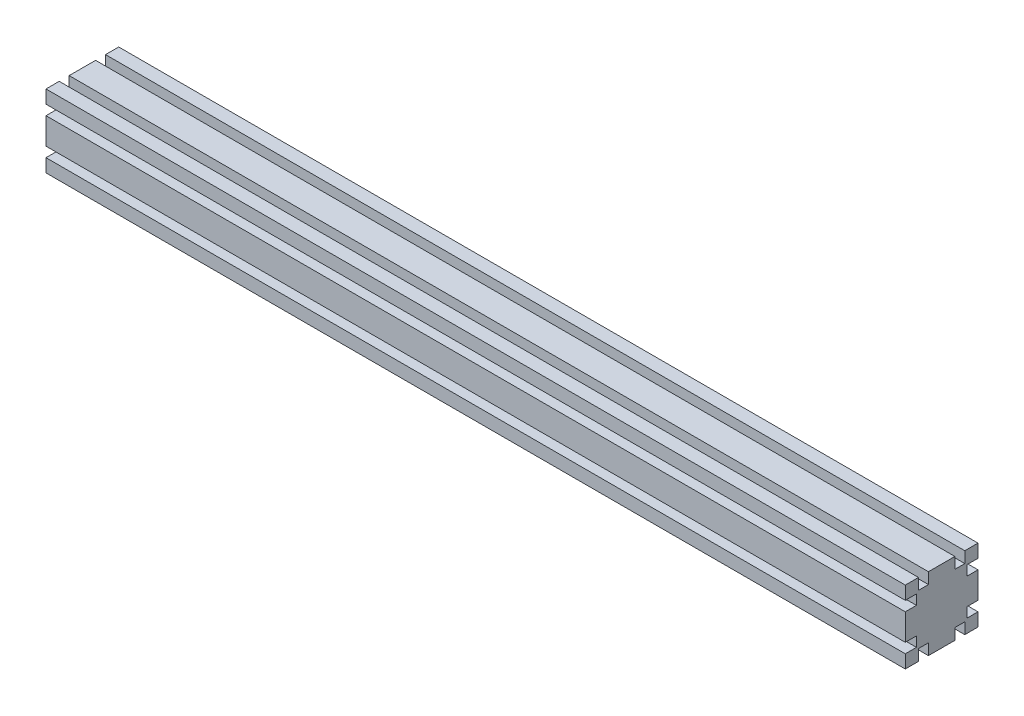
ISO-10303-21;
HEADER;
FILE_DESCRIPTION(('STEP AP214'),'2;1');
FILE_NAME('part.step','',(''),(''),'','','');
FILE_SCHEMA(('AUTOMOTIVE_DESIGN { 1 0 10303 214 1 1 1 1 }'));
ENDSEC;
DATA;
#1=APPLICATION_CONTEXT('core data for automotive mechanical design processes');
#2=APPLICATION_PROTOCOL_DEFINITION('international standard','automotive_design',2000,#1);
#3=PRODUCT_CONTEXT('',#1,'mechanical');
#4=PRODUCT('Part','Part','',(#3));
#5=PRODUCT_RELATED_PRODUCT_CATEGORY('part','',(#4));
#6=PRODUCT_DEFINITION_FORMATION('','',#4);
#7=PRODUCT_DEFINITION_CONTEXT('part definition',#1,'design');
#8=PRODUCT_DEFINITION('design','',#6,#7);
#9=PRODUCT_DEFINITION_SHAPE('','',#8);
#10=(LENGTH_UNIT() NAMED_UNIT(*) SI_UNIT(.MILLI.,.METRE.));
#11=(NAMED_UNIT(*) PLANE_ANGLE_UNIT() SI_UNIT($,.RADIAN.));
#12=(NAMED_UNIT(*) SI_UNIT($,.STERADIAN.) SOLID_ANGLE_UNIT());
#13=UNCERTAINTY_MEASURE_WITH_UNIT(LENGTH_MEASURE(1.E-05),#10,'distance_accuracy_value','');
#14=(GEOMETRIC_REPRESENTATION_CONTEXT(3) GLOBAL_UNCERTAINTY_ASSIGNED_CONTEXT((#13)) GLOBAL_UNIT_ASSIGNED_CONTEXT((#10,
#11,#12)) REPRESENTATION_CONTEXT('',''));
#15=CARTESIAN_POINT('',(0.,0.,0.));
#16=DIRECTION('',(0.,0.,1.));
#17=DIRECTION('',(1.,0.,0.));
#18=AXIS2_PLACEMENT_3D('',#15,#16,#17);
#19=CARTESIAN_POINT('',(709.,30.,-30.));
#20=DIRECTION('',(0.,0.,1.));
#21=DIRECTION('',(0.,-1.,0.));
#22=AXIS2_PLACEMENT_3D('',#19,#20,#21);
#23=PLANE('',#22);
#24=DIRECTION('',(0.,1.,0.));
#25=VECTOR('',#24,1.);
#26=CARTESIAN_POINT('',(709.,30.,-30.));
#27=LINE('',#26,#25);
#28=CARTESIAN_POINT('',(709.,19.1,-30.));
#29=VERTEX_POINT('',#28);
#30=CARTESIAN_POINT('',(709.,30.,-30.));
#31=VERTEX_POINT('',#30);
#32=EDGE_CURVE('E298',#29,#31,#27,.T.);
#33=ORIENTED_EDGE('',*,*,#32,.F.);
#34=DIRECTION('',(-1.,0.,0.));
#35=VECTOR('',#34,1.);
#36=CARTESIAN_POINT('',(709.,19.1,-30.));
#37=LINE('',#36,#35);
#38=CARTESIAN_POINT('',(0.,19.1,-30.));
#39=VERTEX_POINT('',#38);
#40=EDGE_CURVE('E450',#29,#39,#37,.T.);
#41=ORIENTED_EDGE('',*,*,#40,.T.);
#42=DIRECTION('',(0.,1.,0.));
#43=VECTOR('',#42,1.);
#44=CARTESIAN_POINT('',(0.,30.,-30.));
#45=LINE('',#44,#43);
#46=CARTESIAN_POINT('',(0.,30.,-30.));
#47=VERTEX_POINT('',#46);
#48=EDGE_CURVE('E327',#39,#47,#45,.T.);
#49=ORIENTED_EDGE('',*,*,#48,.T.);
#50=DIRECTION('',(-1.,0.,0.));
#51=VECTOR('',#50,1.);
#52=CARTESIAN_POINT('',(709.,30.,-30.));
#53=LINE('',#52,#51);
#54=EDGE_CURVE('E11',#31,#47,#53,.T.);
#55=ORIENTED_EDGE('',*,*,#54,.F.);
#56=EDGE_LOOP('',(#33,#41,#49,#55));
#57=FACE_BOUND('',#56,.T.);
#58=ADVANCED_FACE('F35',(#57),#23,.F.);
#59=CARTESIAN_POINT('',(0.,-10.9,-30.));
#60=VERTEX_POINT('',#59);
#61=CARTESIAN_POINT('',(0.,10.9,-30.));
#62=VERTEX_POINT('',#61);
#63=EDGE_CURVE('E326',#60,#62,#45,.T.);
#64=ORIENTED_EDGE('',*,*,#63,.T.);
#65=DIRECTION('',(-1.,0.,0.));
#66=VECTOR('',#65,1.);
#67=CARTESIAN_POINT('',(709.,10.9,-30.));
#68=LINE('',#67,#66);
#69=CARTESIAN_POINT('',(709.,10.9,-30.));
#70=VERTEX_POINT('',#69);
#71=EDGE_CURVE('E296',#70,#62,#68,.T.);
#72=ORIENTED_EDGE('',*,*,#71,.F.);
#73=CARTESIAN_POINT('',(709.,-10.9,-30.));
#74=VERTEX_POINT('',#73);
#75=EDGE_CURVE('E288',#74,#70,#27,.T.);
#76=ORIENTED_EDGE('',*,*,#75,.F.);
#77=DIRECTION('',(-1.,0.,0.));
#78=VECTOR('',#77,1.);
#79=CARTESIAN_POINT('',(709.,-10.9,-30.));
#80=LINE('',#79,#78);
#81=EDGE_CURVE('E269',#74,#60,#80,.T.);
#82=ORIENTED_EDGE('',*,*,#81,.T.);
#83=EDGE_LOOP('',(#64,#72,#76,#82));
#84=FACE_BOUND('',#83,.T.);
#85=ADVANCED_FACE('F295',(#84),#23,.F.);
#86=CARTESIAN_POINT('',(709.,30.,30.));
#87=DIRECTION('',(0.,-1.,0.));
#88=DIRECTION('',(0.,0.,-1.));
#89=AXIS2_PLACEMENT_3D('',#86,#87,#88);
#90=PLANE('',#89);
#91=DIRECTION('',(0.,0.,1.));
#92=VECTOR('',#91,1.);
#93=CARTESIAN_POINT('',(709.,30.,30.));
#94=LINE('',#93,#92);
#95=CARTESIAN_POINT('',(709.,30.,19.1));
#96=VERTEX_POINT('',#95);
#97=CARTESIAN_POINT('',(709.,30.,30.));
#98=VERTEX_POINT('',#97);
#99=EDGE_CURVE('E301',#96,#98,#94,.T.);
#100=ORIENTED_EDGE('',*,*,#99,.F.);
#101=DIRECTION('',(-1.,0.,0.));
#102=VECTOR('',#101,1.);
#103=CARTESIAN_POINT('',(709.,30.,19.1));
#104=LINE('',#103,#102);
#105=CARTESIAN_POINT('',(0.,30.,19.1));
#106=VERTEX_POINT('',#105);
#107=EDGE_CURVE('E446',#96,#106,#104,.T.);
#108=ORIENTED_EDGE('',*,*,#107,.T.);
#109=DIRECTION('',(0.,0.,1.));
#110=VECTOR('',#109,1.);
#111=CARTESIAN_POINT('',(0.,30.,30.));
#112=LINE('',#111,#110);
#113=CARTESIAN_POINT('',(0.,30.,30.));
#114=VERTEX_POINT('',#113);
#115=EDGE_CURVE('E325',#106,#114,#112,.T.);
#116=ORIENTED_EDGE('',*,*,#115,.T.);
#117=DIRECTION('',(-1.,0.,0.));
#118=VECTOR('',#117,1.);
#119=CARTESIAN_POINT('',(709.,30.,30.));
#120=LINE('',#119,#118);
#121=EDGE_CURVE('E43',#98,#114,#120,.T.);
#122=ORIENTED_EDGE('',*,*,#121,.F.);
#123=EDGE_LOOP('',(#100,#108,#116,#122));
#124=FACE_BOUND('',#123,.T.);
#125=ADVANCED_FACE('F549',(#124),#90,.F.);
#126=CARTESIAN_POINT('',(0.,30.,-10.9));
#127=VERTEX_POINT('',#126);
#128=CARTESIAN_POINT('',(0.,30.,10.9));
#129=VERTEX_POINT('',#128);
#130=EDGE_CURVE('E332',#127,#129,#112,.T.);
#131=ORIENTED_EDGE('',*,*,#130,.T.);
#132=DIRECTION('',(-1.,0.,0.));
#133=VECTOR('',#132,1.);
#134=CARTESIAN_POINT('',(709.,30.,10.9));
#135=LINE('',#134,#133);
#136=CARTESIAN_POINT('',(709.,30.,10.9));
#137=VERTEX_POINT('',#136);
#138=EDGE_CURVE('E58',#137,#129,#135,.T.);
#139=ORIENTED_EDGE('',*,*,#138,.F.);
#140=CARTESIAN_POINT('',(709.,30.,-10.9));
#141=VERTEX_POINT('',#140);
#142=EDGE_CURVE('E311',#141,#137,#94,.T.);
#143=ORIENTED_EDGE('',*,*,#142,.F.);
#144=DIRECTION('',(-1.,0.,0.));
#145=VECTOR('',#144,1.);
#146=CARTESIAN_POINT('',(709.,30.,-10.9));
#147=LINE('',#146,#145);
#148=EDGE_CURVE('E500',#141,#127,#147,.T.);
#149=ORIENTED_EDGE('',*,*,#148,.T.);
#150=EDGE_LOOP('',(#131,#139,#143,#149));
#151=FACE_BOUND('',#150,.T.);
#152=ADVANCED_FACE('F557',(#151),#90,.F.);
#153=CARTESIAN_POINT('',(709.,30.,30.));
#154=DIRECTION('',(0.,0.,-1.));
#155=DIRECTION('',(0.,1.,0.));
#156=AXIS2_PLACEMENT_3D('',#153,#154,#155);
#157=PLANE('',#156);
#158=DIRECTION('',(0.,-1.,0.));
#159=VECTOR('',#158,1.);
#160=CARTESIAN_POINT('',(709.,30.,30.));
#161=LINE('',#160,#159);
#162=CARTESIAN_POINT('',(709.,-19.1,30.));
#163=VERTEX_POINT('',#162);
#164=CARTESIAN_POINT('',(709.,-30.,30.));
#165=VERTEX_POINT('',#164);
#166=EDGE_CURVE('E310',#163,#165,#161,.T.);
#167=ORIENTED_EDGE('',*,*,#166,.F.);
#168=DIRECTION('',(-1.,0.,0.));
#169=VECTOR('',#168,1.);
#170=CARTESIAN_POINT('',(709.,-19.1,30.));
#171=LINE('',#170,#169);
#172=CARTESIAN_POINT('',(0.,-19.1,30.));
#173=VERTEX_POINT('',#172);
#174=EDGE_CURVE('E573',#163,#173,#171,.T.);
#175=ORIENTED_EDGE('',*,*,#174,.T.);
#176=DIRECTION('',(0.,-1.,0.));
#177=VECTOR('',#176,1.);
#178=CARTESIAN_POINT('',(0.,30.,30.));
#179=LINE('',#178,#177);
#180=CARTESIAN_POINT('',(0.,-30.,30.));
#181=VERTEX_POINT('',#180);
#182=EDGE_CURVE('E331',#173,#181,#179,.T.);
#183=ORIENTED_EDGE('',*,*,#182,.T.);
#184=DIRECTION('',(-1.,0.,0.));
#185=VECTOR('',#184,1.);
#186=CARTESIAN_POINT('',(709.,-30.,30.));
#187=LINE('',#186,#185);
#188=EDGE_CURVE('E343',#165,#181,#187,.T.);
#189=ORIENTED_EDGE('',*,*,#188,.F.);
#190=EDGE_LOOP('',(#167,#175,#183,#189));
#191=FACE_BOUND('',#190,.T.);
#192=ADVANCED_FACE('F629',(#191),#157,.F.);
#193=CARTESIAN_POINT('',(0.,10.9,30.));
#194=VERTEX_POINT('',#193);
#195=CARTESIAN_POINT('',(0.,-10.9,30.));
#196=VERTEX_POINT('',#195);
#197=EDGE_CURVE('E337',#194,#196,#179,.T.);
#198=ORIENTED_EDGE('',*,*,#197,.T.);
#199=DIRECTION('',(-1.,0.,0.));
#200=VECTOR('',#199,1.);
#201=CARTESIAN_POINT('',(709.,-10.9,30.));
#202=LINE('',#201,#200);
#203=CARTESIAN_POINT('',(709.,-10.9,30.));
#204=VERTEX_POINT('',#203);
#205=EDGE_CURVE('E591',#204,#196,#202,.T.);
#206=ORIENTED_EDGE('',*,*,#205,.F.);
#207=CARTESIAN_POINT('',(709.,10.9,30.));
#208=VERTEX_POINT('',#207);
#209=EDGE_CURVE('E316',#208,#204,#161,.T.);
#210=ORIENTED_EDGE('',*,*,#209,.F.);
#211=DIRECTION('',(-1.,0.,0.));
#212=VECTOR('',#211,1.);
#213=CARTESIAN_POINT('',(709.,10.9,30.));
#214=LINE('',#213,#212);
#215=EDGE_CURVE('E381',#208,#194,#214,.T.);
#216=ORIENTED_EDGE('',*,*,#215,.T.);
#217=EDGE_LOOP('',(#198,#206,#210,#216));
#218=FACE_BOUND('',#217,.T.);
#219=ADVANCED_FACE('F621',(#218),#157,.F.);
#220=CARTESIAN_POINT('',(709.,-30.,30.));
#221=DIRECTION('',(0.,1.,0.));
#222=DIRECTION('',(0.,0.,1.));
#223=AXIS2_PLACEMENT_3D('',#220,#221,#222);
#224=PLANE('',#223);
#225=DIRECTION('',(0.,0.,-1.));
#226=VECTOR('',#225,1.);
#227=CARTESIAN_POINT('',(709.,-30.,30.));
#228=LINE('',#227,#226);
#229=CARTESIAN_POINT('',(709.,-30.,-19.1));
#230=VERTEX_POINT('',#229);
#231=CARTESIAN_POINT('',(709.,-30.,-30.));
#232=VERTEX_POINT('',#231);
#233=EDGE_CURVE('E315',#230,#232,#228,.T.);
#234=ORIENTED_EDGE('',*,*,#233,.F.);
#235=DIRECTION('',(-1.,0.,0.));
#236=VECTOR('',#235,1.);
#237=CARTESIAN_POINT('',(709.,-30.,-19.1));
#238=LINE('',#237,#236);
#239=CARTESIAN_POINT('',(0.,-30.,-19.1));
#240=VERTEX_POINT('',#239);
#241=EDGE_CURVE('E394',#230,#240,#238,.T.);
#242=ORIENTED_EDGE('',*,*,#241,.T.);
#243=DIRECTION('',(0.,0.,-1.));
#244=VECTOR('',#243,1.);
#245=CARTESIAN_POINT('',(0.,-30.,30.));
#246=LINE('',#245,#244);
#247=CARTESIAN_POINT('',(0.,-30.,-30.));
#248=VERTEX_POINT('',#247);
#249=EDGE_CURVE('E336',#240,#248,#246,.T.);
#250=ORIENTED_EDGE('',*,*,#249,.T.);
#251=DIRECTION('',(-1.,0.,0.));
#252=VECTOR('',#251,1.);
#253=CARTESIAN_POINT('',(709.,-30.,-30.));
#254=LINE('',#253,#252);
#255=EDGE_CURVE('E320',#232,#248,#254,.T.);
#256=ORIENTED_EDGE('',*,*,#255,.F.);
#257=EDGE_LOOP('',(#234,#242,#250,#256));
#258=FACE_BOUND('',#257,.T.);
#259=ADVANCED_FACE('F558',(#258),#224,.F.);
#260=CARTESIAN_POINT('',(0.,-30.,19.1));
#261=VERTEX_POINT('',#260);
#262=EDGE_CURVE('E302',#181,#261,#246,.T.);
#263=ORIENTED_EDGE('',*,*,#262,.T.);
#264=DIRECTION('',(-1.,0.,0.));
#265=VECTOR('',#264,1.);
#266=CARTESIAN_POINT('',(709.,-30.,19.1));
#267=LINE('',#266,#265);
#268=CARTESIAN_POINT('',(709.,-30.,19.1));
#269=VERTEX_POINT('',#268);
#270=EDGE_CURVE('E398',#269,#261,#267,.T.);
#271=ORIENTED_EDGE('',*,*,#270,.F.);
#272=EDGE_CURVE('E317',#165,#269,#228,.T.);
#273=ORIENTED_EDGE('',*,*,#272,.F.);
#274=ORIENTED_EDGE('',*,*,#188,.T.);
#275=EDGE_LOOP('',(#263,#271,#273,#274));
#276=FACE_BOUND('',#275,.T.);
#277=ADVANCED_FACE('F551',(#276),#224,.F.);
#278=CARTESIAN_POINT('',(0.,-19.1,-30.));
#279=VERTEX_POINT('',#278);
#280=EDGE_CURVE('E322',#248,#279,#45,.T.);
#281=ORIENTED_EDGE('',*,*,#280,.T.);
#282=DIRECTION('',(-1.,0.,0.));
#283=VECTOR('',#282,1.);
#284=CARTESIAN_POINT('',(709.,-19.1,-30.));
#285=LINE('',#284,#283);
#286=CARTESIAN_POINT('',(709.,-19.1,-30.));
#287=VERTEX_POINT('',#286);
#288=EDGE_CURVE('E280',#287,#279,#285,.T.);
#289=ORIENTED_EDGE('',*,*,#288,.F.);
#290=EDGE_CURVE('E297',#232,#287,#27,.T.);
#291=ORIENTED_EDGE('',*,*,#290,.F.);
#292=ORIENTED_EDGE('',*,*,#255,.T.);
#293=EDGE_LOOP('',(#281,#289,#291,#292));
#294=FACE_BOUND('',#293,.T.);
#295=ADVANCED_FACE('F37',(#294),#23,.F.);
#296=CARTESIAN_POINT('',(0.,30.,-19.1));
#297=VERTEX_POINT('',#296);
#298=EDGE_CURVE('E328',#47,#297,#112,.T.);
#299=ORIENTED_EDGE('',*,*,#298,.T.);
#300=DIRECTION('',(-1.,0.,0.));
#301=VECTOR('',#300,1.);
#302=CARTESIAN_POINT('',(709.,30.,-19.1));
#303=LINE('',#302,#301);
#304=CARTESIAN_POINT('',(709.,30.,-19.1));
#305=VERTEX_POINT('',#304);
#306=EDGE_CURVE('E305',#305,#297,#303,.T.);
#307=ORIENTED_EDGE('',*,*,#306,.F.);
#308=EDGE_CURVE('E307',#31,#305,#94,.T.);
#309=ORIENTED_EDGE('',*,*,#308,.F.);
#310=ORIENTED_EDGE('',*,*,#54,.T.);
#311=EDGE_LOOP('',(#299,#307,#309,#310));
#312=FACE_BOUND('',#311,.T.);
#313=ADVANCED_FACE('F517',(#312),#90,.F.);
#314=CARTESIAN_POINT('',(0.,19.1,30.));
#315=VERTEX_POINT('',#314);
#316=EDGE_CURVE('E333',#114,#315,#179,.T.);
#317=ORIENTED_EDGE('',*,*,#316,.T.);
#318=DIRECTION('',(-1.,0.,0.));
#319=VECTOR('',#318,1.);
#320=CARTESIAN_POINT('',(709.,19.1,30.));
#321=LINE('',#320,#319);
#322=CARTESIAN_POINT('',(709.,19.1,30.));
#323=VERTEX_POINT('',#322);
#324=EDGE_CURVE('E379',#323,#315,#321,.T.);
#325=ORIENTED_EDGE('',*,*,#324,.F.);
#326=EDGE_CURVE('E312',#98,#323,#161,.T.);
#327=ORIENTED_EDGE('',*,*,#326,.F.);
#328=ORIENTED_EDGE('',*,*,#121,.T.);
#329=EDGE_LOOP('',(#317,#325,#327,#328));
#330=FACE_BOUND('',#329,.T.);
#331=ADVANCED_FACE('F350',(#330),#157,.F.);
#332=CARTESIAN_POINT('',(0.,-30.,10.9));
#333=VERTEX_POINT('',#332);
#334=CARTESIAN_POINT('',(0.,-30.,-10.9));
#335=VERTEX_POINT('',#334);
#336=EDGE_CURVE('E340',#333,#335,#246,.T.);
#337=ORIENTED_EDGE('',*,*,#336,.T.);
#338=DIRECTION('',(-1.,0.,0.));
#339=VECTOR('',#338,1.);
#340=CARTESIAN_POINT('',(709.,-30.,-10.9));
#341=LINE('',#340,#339);
#342=CARTESIAN_POINT('',(709.,-30.,-10.9));
#343=VERTEX_POINT('',#342);
#344=EDGE_CURVE('E408',#343,#335,#341,.T.);
#345=ORIENTED_EDGE('',*,*,#344,.F.);
#346=CARTESIAN_POINT('',(709.,-30.,10.9));
#347=VERTEX_POINT('',#346);
#348=EDGE_CURVE('E321',#347,#343,#228,.T.);
#349=ORIENTED_EDGE('',*,*,#348,.F.);
#350=DIRECTION('',(-1.,0.,0.));
#351=VECTOR('',#350,1.);
#352=CARTESIAN_POINT('',(709.,-30.,10.9));
#353=LINE('',#352,#351);
#354=EDGE_CURVE('E430',#347,#333,#353,.T.);
#355=ORIENTED_EDGE('',*,*,#354,.T.);
#356=EDGE_LOOP('',(#337,#345,#349,#355));
#357=FACE_BOUND('',#356,.T.);
#358=ADVANCED_FACE('F561',(#357),#224,.F.);
#359=CARTESIAN_POINT('',(709.,0.,0.));
#360=DIRECTION('',(1.,0.,0.));
#361=DIRECTION('',(0.,0.,-1.));
#362=AXIS2_PLACEMENT_3D('',#359,#360,#361);
#363=PLANE('',#362);
#364=DIRECTION('',(0.,-1.,0.));
#365=VECTOR('',#364,1.);
#366=CARTESIAN_POINT('',(709.,-30.,-19.1));
#367=LINE('',#366,#365);
#368=CARTESIAN_POINT('',(709.,-20.8,-19.1));
#369=VERTEX_POINT('',#368);
#370=EDGE_CURVE('E385',#369,#230,#367,.T.);
#371=ORIENTED_EDGE('',*,*,#370,.T.);
#372=ORIENTED_EDGE('',*,*,#233,.T.);
#373=ORIENTED_EDGE('',*,*,#290,.T.);
#374=DIRECTION('',(0.,0.,1.));
#375=VECTOR('',#374,1.);
#376=CARTESIAN_POINT('',(709.,-19.1,-30.));
#377=LINE('',#376,#375);
#378=CARTESIAN_POINT('',(709.,-19.1,-20.8));
#379=VERTEX_POINT('',#378);
#380=EDGE_CURVE('E291',#287,#379,#377,.T.);
#381=ORIENTED_EDGE('',*,*,#380,.T.);
#382=DIRECTION('',(0.,1.,0.));
#383=VECTOR('',#382,1.);
#384=CARTESIAN_POINT('',(709.,-19.1,-20.8));
#385=LINE('',#384,#383);
#386=CARTESIAN_POINT('',(709.,-10.9,-20.8));
#387=VERTEX_POINT('',#386);
#388=EDGE_CURVE('E281',#379,#387,#385,.T.);
#389=ORIENTED_EDGE('',*,*,#388,.T.);
#390=DIRECTION('',(0.,0.,-1.));
#391=VECTOR('',#390,1.);
#392=CARTESIAN_POINT('',(709.,-10.9,-20.8));
#393=LINE('',#392,#391);
#394=EDGE_CURVE('E272',#387,#74,#393,.T.);
#395=ORIENTED_EDGE('',*,*,#394,.T.);
#396=ORIENTED_EDGE('',*,*,#75,.T.);
#397=DIRECTION('',(0.,0.,1.));
#398=VECTOR('',#397,1.);
#399=CARTESIAN_POINT('',(709.,10.9,-20.8));
#400=LINE('',#399,#398);
#401=CARTESIAN_POINT('',(709.,10.9,-20.8));
#402=VERTEX_POINT('',#401);
#403=EDGE_CURVE('E460',#70,#402,#400,.T.);
#404=ORIENTED_EDGE('',*,*,#403,.T.);
#405=DIRECTION('',(0.,1.,0.));
#406=VECTOR('',#405,1.);
#407=CARTESIAN_POINT('',(709.,19.1,-20.8));
#408=LINE('',#407,#406);
#409=CARTESIAN_POINT('',(709.,19.1,-20.8));
#410=VERTEX_POINT('',#409);
#411=EDGE_CURVE('E462',#402,#410,#408,.T.);
#412=ORIENTED_EDGE('',*,*,#411,.T.);
#413=DIRECTION('',(0.,0.,-1.));
#414=VECTOR('',#413,1.);
#415=CARTESIAN_POINT('',(709.,19.1,-30.));
#416=LINE('',#415,#414);
#417=EDGE_CURVE('E466',#410,#29,#416,.T.);
#418=ORIENTED_EDGE('',*,*,#417,.T.);
#419=ORIENTED_EDGE('',*,*,#32,.T.);
#420=ORIENTED_EDGE('',*,*,#308,.T.);
#421=DIRECTION('',(0.,-1.,0.));
#422=VECTOR('',#421,1.);
#423=CARTESIAN_POINT('',(709.,30.,-19.1));
#424=LINE('',#423,#422);
#425=CARTESIAN_POINT('',(709.,20.8,-19.1));
#426=VERTEX_POINT('',#425);
#427=EDGE_CURVE('E484',#305,#426,#424,.T.);
#428=ORIENTED_EDGE('',*,*,#427,.T.);
#429=DIRECTION('',(0.,0.,1.));
#430=VECTOR('',#429,1.);
#431=CARTESIAN_POINT('',(709.,20.8,-19.1));
#432=LINE('',#431,#430);
#433=CARTESIAN_POINT('',(709.,20.8,-10.9));
#434=VERTEX_POINT('',#433);
#435=EDGE_CURVE('E487',#426,#434,#432,.T.);
#436=ORIENTED_EDGE('',*,*,#435,.T.);
#437=DIRECTION('',(0.,1.,0.));
#438=VECTOR('',#437,1.);
#439=CARTESIAN_POINT('',(709.,20.8,-10.9));
#440=LINE('',#439,#438);
#441=EDGE_CURVE('E491',#434,#141,#440,.T.);
#442=ORIENTED_EDGE('',*,*,#441,.T.);
#443=ORIENTED_EDGE('',*,*,#142,.T.);
#444=DIRECTION('',(0.,-1.,0.));
#445=VECTOR('',#444,1.);
#446=CARTESIAN_POINT('',(709.,20.8,10.9));
#447=LINE('',#446,#445);
#448=CARTESIAN_POINT('',(709.,20.8,10.9));
#449=VERTEX_POINT('',#448);
#450=EDGE_CURVE('E439',#137,#449,#447,.T.);
#451=ORIENTED_EDGE('',*,*,#450,.T.);
#452=DIRECTION('',(0.,0.,1.));
#453=VECTOR('',#452,1.);
#454=CARTESIAN_POINT('',(709.,20.8,19.1));
#455=LINE('',#454,#453);
#456=CARTESIAN_POINT('',(709.,20.8,19.1));
#457=VERTEX_POINT('',#456);
#458=EDGE_CURVE('E443',#449,#457,#455,.T.);
#459=ORIENTED_EDGE('',*,*,#458,.T.);
#460=DIRECTION('',(0.,1.,0.));
#461=VECTOR('',#460,1.);
#462=CARTESIAN_POINT('',(709.,30.,19.1));
#463=LINE('',#462,#461);
#464=EDGE_CURVE('E436',#457,#96,#463,.T.);
#465=ORIENTED_EDGE('',*,*,#464,.T.);
#466=ORIENTED_EDGE('',*,*,#99,.T.);
#467=ORIENTED_EDGE('',*,*,#326,.T.);
#468=DIRECTION('',(0.,0.,-1.));
#469=VECTOR('',#468,1.);
#470=CARTESIAN_POINT('',(709.,19.1,30.));
#471=LINE('',#470,#469);
#472=CARTESIAN_POINT('',(709.,19.1,20.8));
#473=VERTEX_POINT('',#472);
#474=EDGE_CURVE('E607',#323,#473,#471,.T.);
#475=ORIENTED_EDGE('',*,*,#474,.T.);
#476=DIRECTION('',(0.,-1.,0.));
#477=VECTOR('',#476,1.);
#478=CARTESIAN_POINT('',(709.,19.1,20.8));
#479=LINE('',#478,#477);
#480=CARTESIAN_POINT('',(709.,10.9,20.8));
#481=VERTEX_POINT('',#480);
#482=EDGE_CURVE('E384',#473,#481,#479,.T.);
#483=ORIENTED_EDGE('',*,*,#482,.T.);
#484=DIRECTION('',(0.,0.,1.));
#485=VECTOR('',#484,1.);
#486=CARTESIAN_POINT('',(709.,10.9,20.8));
#487=LINE('',#486,#485);
#488=EDGE_CURVE('E369',#481,#208,#487,.T.);
#489=ORIENTED_EDGE('',*,*,#488,.T.);
#490=ORIENTED_EDGE('',*,*,#209,.T.);
#491=DIRECTION('',(0.,0.,-1.));
#492=VECTOR('',#491,1.);
#493=CARTESIAN_POINT('',(709.,-10.9,20.8));
#494=LINE('',#493,#492);
#495=CARTESIAN_POINT('',(709.,-10.9,20.8));
#496=VERTEX_POINT('',#495);
#497=EDGE_CURVE('E581',#204,#496,#494,.T.);
#498=ORIENTED_EDGE('',*,*,#497,.T.);
#499=DIRECTION('',(0.,-1.,0.));
#500=VECTOR('',#499,1.);
#501=CARTESIAN_POINT('',(709.,-19.1,20.8));
#502=LINE('',#501,#500);
#503=CARTESIAN_POINT('',(709.,-19.1,20.8));
#504=VERTEX_POINT('',#503);
#505=EDGE_CURVE('E584',#496,#504,#502,.T.);
#506=ORIENTED_EDGE('',*,*,#505,.T.);
#507=DIRECTION('',(0.,0.,1.));
#508=VECTOR('',#507,1.);
#509=CARTESIAN_POINT('',(709.,-19.1,30.));
#510=LINE('',#509,#508);
#511=EDGE_CURVE('E588',#504,#163,#510,.T.);
#512=ORIENTED_EDGE('',*,*,#511,.T.);
#513=ORIENTED_EDGE('',*,*,#166,.T.);
#514=ORIENTED_EDGE('',*,*,#272,.T.);
#515=DIRECTION('',(0.,1.,0.));
#516=VECTOR('',#515,1.);
#517=CARTESIAN_POINT('',(709.,-30.,19.1));
#518=LINE('',#517,#516);
#519=CARTESIAN_POINT('',(709.,-20.8,19.1));
#520=VERTEX_POINT('',#519);
#521=EDGE_CURVE('E412',#269,#520,#518,.T.);
#522=ORIENTED_EDGE('',*,*,#521,.T.);
#523=DIRECTION('',(0.,0.,-1.));
#524=VECTOR('',#523,1.);
#525=CARTESIAN_POINT('',(709.,-20.8,19.1));
#526=LINE('',#525,#524);
#527=CARTESIAN_POINT('',(709.,-20.8,10.9));
#528=VERTEX_POINT('',#527);
#529=EDGE_CURVE('E415',#520,#528,#526,.T.);
#530=ORIENTED_EDGE('',*,*,#529,.T.);
#531=DIRECTION('',(0.,-1.,0.));
#532=VECTOR('',#531,1.);
#533=CARTESIAN_POINT('',(709.,-20.8,10.9));
#534=LINE('',#533,#532);
#535=EDGE_CURVE('E419',#528,#347,#534,.T.);
#536=ORIENTED_EDGE('',*,*,#535,.T.);
#537=ORIENTED_EDGE('',*,*,#348,.T.);
#538=DIRECTION('',(0.,1.,0.));
#539=VECTOR('',#538,1.);
#540=CARTESIAN_POINT('',(709.,-20.8,-10.9));
#541=LINE('',#540,#539);
#542=CARTESIAN_POINT('',(709.,-20.8,-10.9));
#543=VERTEX_POINT('',#542);
#544=EDGE_CURVE('E387',#343,#543,#541,.T.);
#545=ORIENTED_EDGE('',*,*,#544,.T.);
#546=DIRECTION('',(0.,0.,-1.));
#547=VECTOR('',#546,1.);
#548=CARTESIAN_POINT('',(709.,-20.8,-19.1));
#549=LINE('',#548,#547);
#550=EDGE_CURVE('E391',#543,#369,#549,.T.);
#551=ORIENTED_EDGE('',*,*,#550,.T.);
#552=EDGE_LOOP('',(#371,#372,#373,#381,#389,#395,#396,#404,#412,#418,#419,#420,#428,#436,#442,
#443,#451,#459,#465,#466,#467,#475,#483,#489,#490,#498,#506,#512,#513,#514,#522,#530,#536,#537,
#545,#551));
#553=FACE_BOUND('',#552,.T.);
#554=ADVANCED_FACE('F286',(#553),#363,.T.);
#555=CARTESIAN_POINT('',(0.,0.,0.));
#556=DIRECTION('',(1.,0.,0.));
#557=DIRECTION('',(0.,0.,-1.));
#558=AXIS2_PLACEMENT_3D('',#555,#556,#557);
#559=PLANE('',#558);
#560=ORIENTED_EDGE('',*,*,#249,.F.);
#561=DIRECTION('',(0.,-1.,0.));
#562=VECTOR('',#561,1.);
#563=CARTESIAN_POINT('',(0.,-30.,-19.1));
#564=LINE('',#563,#562);
#565=CARTESIAN_POINT('',(0.,-20.8,-19.1));
#566=VERTEX_POINT('',#565);
#567=EDGE_CURVE('E395',#566,#240,#564,.T.);
#568=ORIENTED_EDGE('',*,*,#567,.F.);
#569=DIRECTION('',(0.,0.,-1.));
#570=VECTOR('',#569,1.);
#571=CARTESIAN_POINT('',(0.,-20.8,-19.1));
#572=LINE('',#571,#570);
#573=CARTESIAN_POINT('',(0.,-20.8,-10.9));
#574=VERTEX_POINT('',#573);
#575=EDGE_CURVE('E388',#574,#566,#572,.T.);
#576=ORIENTED_EDGE('',*,*,#575,.F.);
#577=DIRECTION('',(0.,1.,0.));
#578=VECTOR('',#577,1.);
#579=CARTESIAN_POINT('',(0.,-20.8,-10.9));
#580=LINE('',#579,#578);
#581=EDGE_CURVE('E397',#335,#574,#580,.T.);
#582=ORIENTED_EDGE('',*,*,#581,.F.);
#583=ORIENTED_EDGE('',*,*,#336,.F.);
#584=DIRECTION('',(0.,-1.,0.));
#585=VECTOR('',#584,1.);
#586=CARTESIAN_POINT('',(0.,-20.8,10.9));
#587=LINE('',#586,#585);
#588=CARTESIAN_POINT('',(0.,-20.8,10.9));
#589=VERTEX_POINT('',#588);
#590=EDGE_CURVE('E416',#589,#333,#587,.T.);
#591=ORIENTED_EDGE('',*,*,#590,.F.);
#592=DIRECTION('',(0.,0.,-1.));
#593=VECTOR('',#592,1.);
#594=CARTESIAN_POINT('',(0.,-20.8,19.1));
#595=LINE('',#594,#593);
#596=CARTESIAN_POINT('',(0.,-20.8,19.1));
#597=VERTEX_POINT('',#596);
#598=EDGE_CURVE('E424',#597,#589,#595,.T.);
#599=ORIENTED_EDGE('',*,*,#598,.F.);
#600=DIRECTION('',(0.,1.,0.));
#601=VECTOR('',#600,1.);
#602=CARTESIAN_POINT('',(0.,-30.,19.1));
#603=LINE('',#602,#601);
#604=EDGE_CURVE('E50',#261,#597,#603,.T.);
#605=ORIENTED_EDGE('',*,*,#604,.F.);
#606=ORIENTED_EDGE('',*,*,#262,.F.);
#607=ORIENTED_EDGE('',*,*,#182,.F.);
#608=DIRECTION('',(0.,0.,1.));
#609=VECTOR('',#608,1.);
#610=CARTESIAN_POINT('',(0.,-19.1,30.));
#611=LINE('',#610,#609);
#612=CARTESIAN_POINT('',(0.,-19.1,20.8));
#613=VERTEX_POINT('',#612);
#614=EDGE_CURVE('E585',#613,#173,#611,.T.);
#615=ORIENTED_EDGE('',*,*,#614,.F.);
#616=DIRECTION('',(0.,-1.,0.));
#617=VECTOR('',#616,1.);
#618=CARTESIAN_POINT('',(0.,-19.1,20.8));
#619=LINE('',#618,#617);
#620=CARTESIAN_POINT('',(0.,-10.9,20.8));
#621=VERTEX_POINT('',#620);
#622=EDGE_CURVE('E594',#621,#613,#619,.T.);
#623=ORIENTED_EDGE('',*,*,#622,.F.);
#624=DIRECTION('',(0.,0.,-1.));
#625=VECTOR('',#624,1.);
#626=CARTESIAN_POINT('',(0.,-10.9,20.8));
#627=LINE('',#626,#625);
#628=EDGE_CURVE('E376',#196,#621,#627,.T.);
#629=ORIENTED_EDGE('',*,*,#628,.F.);
#630=ORIENTED_EDGE('',*,*,#197,.F.);
#631=DIRECTION('',(0.,0.,1.));
#632=VECTOR('',#631,1.);
#633=CARTESIAN_POINT('',(0.,10.9,20.8));
#634=LINE('',#633,#632);
#635=CARTESIAN_POINT('',(0.,10.9,20.8));
#636=VERTEX_POINT('',#635);
#637=EDGE_CURVE('E367',#636,#194,#634,.T.);
#638=ORIENTED_EDGE('',*,*,#637,.F.);
#639=DIRECTION('',(0.,-1.,0.));
#640=VECTOR('',#639,1.);
#641=CARTESIAN_POINT('',(0.,19.1,20.8));
#642=LINE('',#641,#640);
#643=CARTESIAN_POINT('',(0.,19.1,20.8));
#644=VERTEX_POINT('',#643);
#645=EDGE_CURVE('E365',#644,#636,#642,.T.);
#646=ORIENTED_EDGE('',*,*,#645,.F.);
#647=DIRECTION('',(0.,0.,-1.));
#648=VECTOR('',#647,1.);
#649=CARTESIAN_POINT('',(0.,19.1,30.));
#650=LINE('',#649,#648);
#651=EDGE_CURVE('E362',#315,#644,#650,.T.);
#652=ORIENTED_EDGE('',*,*,#651,.F.);
#653=ORIENTED_EDGE('',*,*,#316,.F.);
#654=ORIENTED_EDGE('',*,*,#115,.F.);
#655=DIRECTION('',(0.,1.,0.));
#656=VECTOR('',#655,1.);
#657=CARTESIAN_POINT('',(0.,30.,19.1));
#658=LINE('',#657,#656);
#659=CARTESIAN_POINT('',(0.,20.8,19.1));
#660=VERTEX_POINT('',#659);
#661=EDGE_CURVE('E447',#660,#106,#658,.T.);
#662=ORIENTED_EDGE('',*,*,#661,.F.);
#663=DIRECTION('',(0.,0.,1.));
#664=VECTOR('',#663,1.);
#665=CARTESIAN_POINT('',(0.,20.8,19.1));
#666=LINE('',#665,#664);
#667=CARTESIAN_POINT('',(0.,20.8,10.9));
#668=VERTEX_POINT('',#667);
#669=EDGE_CURVE('E440',#668,#660,#666,.T.);
#670=ORIENTED_EDGE('',*,*,#669,.F.);
#671=DIRECTION('',(0.,-1.,0.));
#672=VECTOR('',#671,1.);
#673=CARTESIAN_POINT('',(0.,20.8,10.9));
#674=LINE('',#673,#672);
#675=EDGE_CURVE('E449',#129,#668,#674,.T.);
#676=ORIENTED_EDGE('',*,*,#675,.F.);
#677=ORIENTED_EDGE('',*,*,#130,.F.);
#678=DIRECTION('',(0.,1.,0.));
#679=VECTOR('',#678,1.);
#680=CARTESIAN_POINT('',(0.,20.8,-10.9));
#681=LINE('',#680,#679);
#682=CARTESIAN_POINT('',(0.,20.8,-10.9));
#683=VERTEX_POINT('',#682);
#684=EDGE_CURVE('E488',#683,#127,#681,.T.);
#685=ORIENTED_EDGE('',*,*,#684,.F.);
#686=DIRECTION('',(0.,0.,1.));
#687=VECTOR('',#686,1.);
#688=CARTESIAN_POINT('',(0.,20.8,-19.1));
#689=LINE('',#688,#687);
#690=CARTESIAN_POINT('',(0.,20.8,-19.1));
#691=VERTEX_POINT('',#690);
#692=EDGE_CURVE('E496',#691,#683,#689,.T.);
#693=ORIENTED_EDGE('',*,*,#692,.F.);
#694=DIRECTION('',(0.,-1.,0.));
#695=VECTOR('',#694,1.);
#696=CARTESIAN_POINT('',(0.,30.,-19.1));
#697=LINE('',#696,#695);
#698=EDGE_CURVE('E405',#297,#691,#697,.T.);
#699=ORIENTED_EDGE('',*,*,#698,.F.);
#700=ORIENTED_EDGE('',*,*,#298,.F.);
#701=ORIENTED_EDGE('',*,*,#48,.F.);
#702=DIRECTION('',(0.,0.,-1.));
#703=VECTOR('',#702,1.);
#704=CARTESIAN_POINT('',(0.,19.1,-30.));
#705=LINE('',#704,#703);
#706=CARTESIAN_POINT('',(0.,19.1,-20.8));
#707=VERTEX_POINT('',#706);
#708=EDGE_CURVE('E463',#707,#39,#705,.T.);
#709=ORIENTED_EDGE('',*,*,#708,.F.);
#710=DIRECTION('',(0.,1.,0.));
#711=VECTOR('',#710,1.);
#712=CARTESIAN_POINT('',(0.,19.1,-20.8));
#713=LINE('',#712,#711);
#714=CARTESIAN_POINT('',(0.,10.9,-20.8));
#715=VERTEX_POINT('',#714);
#716=EDGE_CURVE('E472',#715,#707,#713,.T.);
#717=ORIENTED_EDGE('',*,*,#716,.F.);
#718=DIRECTION('',(0.,0.,1.));
#719=VECTOR('',#718,1.);
#720=CARTESIAN_POINT('',(0.,10.9,-20.8));
#721=LINE('',#720,#719);
#722=EDGE_CURVE('E469',#62,#715,#721,.T.);
#723=ORIENTED_EDGE('',*,*,#722,.F.);
#724=ORIENTED_EDGE('',*,*,#63,.F.);
#725=DIRECTION('',(0.,0.,-1.));
#726=VECTOR('',#725,1.);
#727=CARTESIAN_POINT('',(0.,-10.9,-20.8));
#728=LINE('',#727,#726);
#729=CARTESIAN_POINT('',(0.,-10.9,-20.8));
#730=VERTEX_POINT('',#729);
#731=EDGE_CURVE('E275',#730,#60,#728,.T.);
#732=ORIENTED_EDGE('',*,*,#731,.F.);
#733=DIRECTION('',(0.,1.,0.));
#734=VECTOR('',#733,1.);
#735=CARTESIAN_POINT('',(0.,-19.1,-20.8));
#736=LINE('',#735,#734);
#737=CARTESIAN_POINT('',(0.,-19.1,-20.8));
#738=VERTEX_POINT('',#737);
#739=EDGE_CURVE('E292',#738,#730,#736,.T.);
#740=ORIENTED_EDGE('',*,*,#739,.F.);
#741=DIRECTION('',(0.,0.,1.));
#742=VECTOR('',#741,1.);
#743=CARTESIAN_POINT('',(0.,-19.1,-30.));
#744=LINE('',#743,#742);
#745=EDGE_CURVE('E569',#279,#738,#744,.T.);
#746=ORIENTED_EDGE('',*,*,#745,.F.);
#747=ORIENTED_EDGE('',*,*,#280,.F.);
#748=EDGE_LOOP('',(#560,#568,#576,#582,#583,#591,#599,#605,#606,#607,#615,#623,#629,#630,#638,
#646,#652,#653,#654,#662,#670,#676,#677,#685,#693,#699,#700,#701,#709,#717,#723,#724,#732,#740,
#746,#747));
#749=FACE_BOUND('',#748,.T.);
#750=ADVANCED_FACE('F358',(#749),#559,.F.);
#751=CARTESIAN_POINT('',(709.,20.8,-10.9));
#752=DIRECTION('',(0.,0.,1.));
#753=DIRECTION('',(1.,0.,0.));
#754=AXIS2_PLACEMENT_3D('',#751,#752,#753);
#755=PLANE('',#754);
#756=ORIENTED_EDGE('',*,*,#684,.T.);
#757=ORIENTED_EDGE('',*,*,#148,.F.);
#758=ORIENTED_EDGE('',*,*,#441,.F.);
#759=DIRECTION('',(-1.,0.,0.));
#760=VECTOR('',#759,1.);
#761=CARTESIAN_POINT('',(709.,20.8,-10.9));
#762=LINE('',#761,#760);
#763=EDGE_CURVE('E503',#434,#683,#762,.T.);
#764=ORIENTED_EDGE('',*,*,#763,.T.);
#765=EDGE_LOOP('',(#756,#757,#758,#764));
#766=FACE_BOUND('',#765,.T.);
#767=ADVANCED_FACE('F710',(#766),#755,.F.);
#768=CARTESIAN_POINT('',(709.,20.8,-19.1));
#769=DIRECTION('',(0.,-1.,0.));
#770=DIRECTION('',(0.,0.,-1.));
#771=AXIS2_PLACEMENT_3D('',#768,#769,#770);
#772=PLANE('',#771);
#773=ORIENTED_EDGE('',*,*,#692,.T.);
#774=ORIENTED_EDGE('',*,*,#763,.F.);
#775=ORIENTED_EDGE('',*,*,#435,.F.);
#776=DIRECTION('',(-1.,0.,0.));
#777=VECTOR('',#776,1.);
#778=CARTESIAN_POINT('',(709.,20.8,-19.1));
#779=LINE('',#778,#777);
#780=EDGE_CURVE('E504',#426,#691,#779,.T.);
#781=ORIENTED_EDGE('',*,*,#780,.T.);
#782=EDGE_LOOP('',(#773,#774,#775,#781));
#783=FACE_BOUND('',#782,.T.);
#784=ADVANCED_FACE('F711',(#783),#772,.F.);
#785=CARTESIAN_POINT('',(709.,30.,-19.1));
#786=DIRECTION('',(0.,0.,-1.));
#787=DIRECTION('',(-1.,0.,0.));
#788=AXIS2_PLACEMENT_3D('',#785,#786,#787);
#789=PLANE('',#788);
#790=ORIENTED_EDGE('',*,*,#698,.T.);
#791=ORIENTED_EDGE('',*,*,#780,.F.);
#792=ORIENTED_EDGE('',*,*,#427,.F.);
#793=ORIENTED_EDGE('',*,*,#306,.T.);
#794=EDGE_LOOP('',(#790,#791,#792,#793));
#795=FACE_BOUND('',#794,.T.);
#796=ADVANCED_FACE('F510',(#795),#789,.F.);
#797=CARTESIAN_POINT('',(709.,10.9,20.8));
#798=DIRECTION('',(0.,-1.,0.));
#799=DIRECTION('',(0.,0.,-1.));
#800=AXIS2_PLACEMENT_3D('',#797,#798,#799);
#801=PLANE('',#800);
#802=ORIENTED_EDGE('',*,*,#637,.T.);
#803=ORIENTED_EDGE('',*,*,#215,.F.);
#804=ORIENTED_EDGE('',*,*,#488,.F.);
#805=DIRECTION('',(-1.,0.,0.));
#806=VECTOR('',#805,1.);
#807=CARTESIAN_POINT('',(709.,10.9,20.8));
#808=LINE('',#807,#806);
#809=EDGE_CURVE('E374',#481,#636,#808,.T.);
#810=ORIENTED_EDGE('',*,*,#809,.T.);
#811=EDGE_LOOP('',(#802,#803,#804,#810));
#812=FACE_BOUND('',#811,.T.);
#813=ADVANCED_FACE('F617',(#812),#801,.F.);
#814=CARTESIAN_POINT('',(709.,19.1,20.8));
#815=DIRECTION('',(0.,0.,-1.));
#816=DIRECTION('',(0.,1.,0.));
#817=AXIS2_PLACEMENT_3D('',#814,#815,#816);
#818=PLANE('',#817);
#819=ORIENTED_EDGE('',*,*,#645,.T.);
#820=ORIENTED_EDGE('',*,*,#809,.F.);
#821=ORIENTED_EDGE('',*,*,#482,.F.);
#822=DIRECTION('',(-1.,0.,0.));
#823=VECTOR('',#822,1.);
#824=CARTESIAN_POINT('',(709.,19.1,20.8));
#825=LINE('',#824,#823);
#826=EDGE_CURVE('E377',#473,#644,#825,.T.);
#827=ORIENTED_EDGE('',*,*,#826,.T.);
#828=EDGE_LOOP('',(#819,#820,#821,#827));
#829=FACE_BOUND('',#828,.T.);
#830=ADVANCED_FACE('F615',(#829),#818,.F.);
#831=CARTESIAN_POINT('',(709.,19.1,30.));
#832=DIRECTION('',(0.,1.,0.));
#833=DIRECTION('',(0.,0.,1.));
#834=AXIS2_PLACEMENT_3D('',#831,#832,#833);
#835=PLANE('',#834);
#836=ORIENTED_EDGE('',*,*,#651,.T.);
#837=ORIENTED_EDGE('',*,*,#826,.F.);
#838=ORIENTED_EDGE('',*,*,#474,.F.);
#839=ORIENTED_EDGE('',*,*,#324,.T.);
#840=EDGE_LOOP('',(#836,#837,#838,#839));
#841=FACE_BOUND('',#840,.T.);
#842=ADVANCED_FACE('F651',(#841),#835,.F.);
#843=CARTESIAN_POINT('',(709.,-19.1,30.));
#844=DIRECTION('',(0.,-1.,0.));
#845=DIRECTION('',(0.,0.,-1.));
#846=AXIS2_PLACEMENT_3D('',#843,#844,#845);
#847=PLANE('',#846);
#848=ORIENTED_EDGE('',*,*,#614,.T.);
#849=ORIENTED_EDGE('',*,*,#174,.F.);
#850=ORIENTED_EDGE('',*,*,#511,.F.);
#851=DIRECTION('',(-1.,0.,0.));
#852=VECTOR('',#851,1.);
#853=CARTESIAN_POINT('',(709.,-19.1,20.8));
#854=LINE('',#853,#852);
#855=EDGE_CURVE('E600',#504,#613,#854,.T.);
#856=ORIENTED_EDGE('',*,*,#855,.T.);
#857=EDGE_LOOP('',(#848,#849,#850,#856));
#858=FACE_BOUND('',#857,.T.);
#859=ADVANCED_FACE('F649',(#858),#847,.F.);
#860=CARTESIAN_POINT('',(709.,-19.1,20.8));
#861=DIRECTION('',(0.,0.,-1.));
#862=DIRECTION('',(0.,1.,0.));
#863=AXIS2_PLACEMENT_3D('',#860,#861,#862);
#864=PLANE('',#863);
#865=ORIENTED_EDGE('',*,*,#622,.T.);
#866=ORIENTED_EDGE('',*,*,#855,.F.);
#867=ORIENTED_EDGE('',*,*,#505,.F.);
#868=DIRECTION('',(-1.,0.,0.));
#869=VECTOR('',#868,1.);
#870=CARTESIAN_POINT('',(709.,-10.9,20.8));
#871=LINE('',#870,#869);
#872=EDGE_CURVE('E602',#496,#621,#871,.T.);
#873=ORIENTED_EDGE('',*,*,#872,.T.);
#874=EDGE_LOOP('',(#865,#866,#867,#873));
#875=FACE_BOUND('',#874,.T.);
#876=ADVANCED_FACE('F647',(#875),#864,.F.);
#877=CARTESIAN_POINT('',(709.,-10.9,20.8));
#878=DIRECTION('',(0.,1.,0.));
#879=DIRECTION('',(0.,0.,1.));
#880=AXIS2_PLACEMENT_3D('',#877,#878,#879);
#881=PLANE('',#880);
#882=ORIENTED_EDGE('',*,*,#628,.T.);
#883=ORIENTED_EDGE('',*,*,#872,.F.);
#884=ORIENTED_EDGE('',*,*,#497,.F.);
#885=ORIENTED_EDGE('',*,*,#205,.T.);
#886=EDGE_LOOP('',(#882,#883,#884,#885));
#887=FACE_BOUND('',#886,.T.);
#888=ADVANCED_FACE('F645',(#887),#881,.F.);
#889=CARTESIAN_POINT('',(709.,-10.9,-20.8));
#890=DIRECTION('',(0.,1.,0.));
#891=DIRECTION('',(0.,0.,1.));
#892=AXIS2_PLACEMENT_3D('',#889,#890,#891);
#893=PLANE('',#892);
#894=ORIENTED_EDGE('',*,*,#731,.T.);
#895=ORIENTED_EDGE('',*,*,#81,.F.);
#896=ORIENTED_EDGE('',*,*,#394,.F.);
#897=DIRECTION('',(-1.,0.,0.));
#898=VECTOR('',#897,1.);
#899=CARTESIAN_POINT('',(709.,-10.9,-20.8));
#900=LINE('',#899,#898);
#901=EDGE_CURVE('E473',#387,#730,#900,.T.);
#902=ORIENTED_EDGE('',*,*,#901,.T.);
#903=EDGE_LOOP('',(#894,#895,#896,#902));
#904=FACE_BOUND('',#903,.T.);
#905=ADVANCED_FACE('F271',(#904),#893,.F.);
#906=CARTESIAN_POINT('',(709.,-19.1,-20.8));
#907=DIRECTION('',(0.,0.,1.));
#908=DIRECTION('',(0.,-1.,0.));
#909=AXIS2_PLACEMENT_3D('',#906,#907,#908);
#910=PLANE('',#909);
#911=ORIENTED_EDGE('',*,*,#739,.T.);
#912=ORIENTED_EDGE('',*,*,#901,.F.);
#913=ORIENTED_EDGE('',*,*,#388,.F.);
#914=DIRECTION('',(-1.,0.,0.));
#915=VECTOR('',#914,1.);
#916=CARTESIAN_POINT('',(709.,-19.1,-20.8));
#917=LINE('',#916,#915);
#918=EDGE_CURVE('E578',#379,#738,#917,.T.);
#919=ORIENTED_EDGE('',*,*,#918,.T.);
#920=EDGE_LOOP('',(#911,#912,#913,#919));
#921=FACE_BOUND('',#920,.T.);
#922=ADVANCED_FACE('F541',(#921),#910,.F.);
#923=CARTESIAN_POINT('',(709.,-19.1,-30.));
#924=DIRECTION('',(0.,-1.,0.));
#925=DIRECTION('',(0.,0.,-1.));
#926=AXIS2_PLACEMENT_3D('',#923,#924,#925);
#927=PLANE('',#926);
#928=ORIENTED_EDGE('',*,*,#745,.T.);
#929=ORIENTED_EDGE('',*,*,#918,.F.);
#930=ORIENTED_EDGE('',*,*,#380,.F.);
#931=ORIENTED_EDGE('',*,*,#288,.T.);
#932=EDGE_LOOP('',(#928,#929,#930,#931));
#933=FACE_BOUND('',#932,.T.);
#934=ADVANCED_FACE('F534',(#933),#927,.F.);
#935=CARTESIAN_POINT('',(709.,19.1,-30.));
#936=DIRECTION('',(0.,1.,0.));
#937=DIRECTION('',(0.,0.,1.));
#938=AXIS2_PLACEMENT_3D('',#935,#936,#937);
#939=PLANE('',#938);
#940=ORIENTED_EDGE('',*,*,#708,.T.);
#941=ORIENTED_EDGE('',*,*,#40,.F.);
#942=ORIENTED_EDGE('',*,*,#417,.F.);
#943=DIRECTION('',(-1.,0.,0.));
#944=VECTOR('',#943,1.);
#945=CARTESIAN_POINT('',(709.,19.1,-20.8));
#946=LINE('',#945,#944);
#947=EDGE_CURVE('E479',#410,#707,#946,.T.);
#948=ORIENTED_EDGE('',*,*,#947,.T.);
#949=EDGE_LOOP('',(#940,#941,#942,#948));
#950=FACE_BOUND('',#949,.T.);
#951=ADVANCED_FACE('F532',(#950),#939,.F.);
#952=CARTESIAN_POINT('',(709.,19.1,-20.8));
#953=DIRECTION('',(0.,0.,1.));
#954=DIRECTION('',(0.,-1.,0.));
#955=AXIS2_PLACEMENT_3D('',#952,#953,#954);
#956=PLANE('',#955);
#957=ORIENTED_EDGE('',*,*,#716,.T.);
#958=ORIENTED_EDGE('',*,*,#947,.F.);
#959=ORIENTED_EDGE('',*,*,#411,.F.);
#960=DIRECTION('',(-1.,0.,0.));
#961=VECTOR('',#960,1.);
#962=CARTESIAN_POINT('',(709.,10.9,-20.8));
#963=LINE('',#962,#961);
#964=EDGE_CURVE('E481',#402,#715,#963,.T.);
#965=ORIENTED_EDGE('',*,*,#964,.T.);
#966=EDGE_LOOP('',(#957,#958,#959,#965));
#967=FACE_BOUND('',#966,.T.);
#968=ADVANCED_FACE('F530',(#967),#956,.F.);
#969=CARTESIAN_POINT('',(709.,10.9,-20.8));
#970=DIRECTION('',(0.,-1.,0.));
#971=DIRECTION('',(0.,0.,-1.));
#972=AXIS2_PLACEMENT_3D('',#969,#970,#971);
#973=PLANE('',#972);
#974=ORIENTED_EDGE('',*,*,#722,.T.);
#975=ORIENTED_EDGE('',*,*,#964,.F.);
#976=ORIENTED_EDGE('',*,*,#403,.F.);
#977=ORIENTED_EDGE('',*,*,#71,.T.);
#978=EDGE_LOOP('',(#974,#975,#976,#977));
#979=FACE_BOUND('',#978,.T.);
#980=ADVANCED_FACE('F526',(#979),#973,.F.);
#981=CARTESIAN_POINT('',(709.,30.,19.1));
#982=DIRECTION('',(0.,0.,1.));
#983=DIRECTION('',(1.,0.,0.));
#984=AXIS2_PLACEMENT_3D('',#981,#982,#983);
#985=PLANE('',#984);
#986=ORIENTED_EDGE('',*,*,#661,.T.);
#987=ORIENTED_EDGE('',*,*,#107,.F.);
#988=ORIENTED_EDGE('',*,*,#464,.F.);
#989=DIRECTION('',(-1.,0.,0.));
#990=VECTOR('',#989,1.);
#991=CARTESIAN_POINT('',(709.,20.8,19.1));
#992=LINE('',#991,#990);
#993=EDGE_CURVE('E425',#457,#660,#992,.T.);
#994=ORIENTED_EDGE('',*,*,#993,.T.);
#995=EDGE_LOOP('',(#986,#987,#988,#994));
#996=FACE_BOUND('',#995,.T.);
#997=ADVANCED_FACE('F691',(#996),#985,.F.);
#998=CARTESIAN_POINT('',(709.,20.8,19.1));
#999=DIRECTION('',(0.,-1.,0.));
#1000=DIRECTION('',(0.,0.,-1.));
#1001=AXIS2_PLACEMENT_3D('',#998,#999,#1000);
#1002=PLANE('',#1001);
#1003=ORIENTED_EDGE('',*,*,#669,.T.);
#1004=ORIENTED_EDGE('',*,*,#993,.F.);
#1005=ORIENTED_EDGE('',*,*,#458,.F.);
#1006=DIRECTION('',(-1.,0.,0.));
#1007=VECTOR('',#1006,1.);
#1008=CARTESIAN_POINT('',(709.,20.8,10.9));
#1009=LINE('',#1008,#1007);
#1010=EDGE_CURVE('E455',#449,#668,#1009,.T.);
#1011=ORIENTED_EDGE('',*,*,#1010,.T.);
#1012=EDGE_LOOP('',(#1003,#1004,#1005,#1011));
#1013=FACE_BOUND('',#1012,.T.);
#1014=ADVANCED_FACE('F688',(#1013),#1002,.F.);
#1015=CARTESIAN_POINT('',(709.,20.8,10.9));
#1016=DIRECTION('',(0.,0.,-1.));
#1017=DIRECTION('',(-1.,0.,0.));
#1018=AXIS2_PLACEMENT_3D('',#1015,#1016,#1017);
#1019=PLANE('',#1018);
#1020=ORIENTED_EDGE('',*,*,#675,.T.);
#1021=ORIENTED_EDGE('',*,*,#1010,.F.);
#1022=ORIENTED_EDGE('',*,*,#450,.F.);
#1023=ORIENTED_EDGE('',*,*,#138,.T.);
#1024=EDGE_LOOP('',(#1020,#1021,#1022,#1023));
#1025=FACE_BOUND('',#1024,.T.);
#1026=ADVANCED_FACE('F687',(#1025),#1019,.F.);
#1027=CARTESIAN_POINT('',(709.,-30.,19.1));
#1028=DIRECTION('',(0.,0.,1.));
#1029=DIRECTION('',(1.,0.,0.));
#1030=AXIS2_PLACEMENT_3D('',#1027,#1028,#1029);
#1031=PLANE('',#1030);
#1032=ORIENTED_EDGE('',*,*,#604,.T.);
#1033=DIRECTION('',(-1.,0.,0.));
#1034=VECTOR('',#1033,1.);
#1035=CARTESIAN_POINT('',(709.,-20.8,19.1));
#1036=LINE('',#1035,#1034);
#1037=EDGE_CURVE('E422',#520,#597,#1036,.T.);
#1038=ORIENTED_EDGE('',*,*,#1037,.F.);
#1039=ORIENTED_EDGE('',*,*,#521,.F.);
#1040=ORIENTED_EDGE('',*,*,#270,.T.);
#1041=EDGE_LOOP('',(#1032,#1038,#1039,#1040));
#1042=FACE_BOUND('',#1041,.T.);
#1043=ADVANCED_FACE('F641',(#1042),#1031,.F.);
#1044=CARTESIAN_POINT('',(709.,-20.8,10.9));
#1045=DIRECTION('',(0.,0.,-1.));
#1046=DIRECTION('',(-1.,0.,0.));
#1047=AXIS2_PLACEMENT_3D('',#1044,#1045,#1046);
#1048=PLANE('',#1047);
#1049=ORIENTED_EDGE('',*,*,#590,.T.);
#1050=ORIENTED_EDGE('',*,*,#354,.F.);
#1051=ORIENTED_EDGE('',*,*,#535,.F.);
#1052=DIRECTION('',(-1.,0.,0.));
#1053=VECTOR('',#1052,1.);
#1054=CARTESIAN_POINT('',(709.,-20.8,10.9));
#1055=LINE('',#1054,#1053);
#1056=EDGE_CURVE('E433',#528,#589,#1055,.T.);
#1057=ORIENTED_EDGE('',*,*,#1056,.T.);
#1058=EDGE_LOOP('',(#1049,#1050,#1051,#1057));
#1059=FACE_BOUND('',#1058,.T.);
#1060=ADVANCED_FACE('F679',(#1059),#1048,.F.);
#1061=CARTESIAN_POINT('',(709.,-20.8,19.1));
#1062=DIRECTION('',(0.,1.,0.));
#1063=DIRECTION('',(0.,0.,1.));
#1064=AXIS2_PLACEMENT_3D('',#1061,#1062,#1063);
#1065=PLANE('',#1064);
#1066=ORIENTED_EDGE('',*,*,#598,.T.);
#1067=ORIENTED_EDGE('',*,*,#1056,.F.);
#1068=ORIENTED_EDGE('',*,*,#529,.F.);
#1069=ORIENTED_EDGE('',*,*,#1037,.T.);
#1070=EDGE_LOOP('',(#1066,#1067,#1068,#1069));
#1071=FACE_BOUND('',#1070,.T.);
#1072=ADVANCED_FACE('F638',(#1071),#1065,.F.);
#1073=CARTESIAN_POINT('',(709.,-30.,-19.1));
#1074=DIRECTION('',(0.,0.,-1.));
#1075=DIRECTION('',(-1.,0.,0.));
#1076=AXIS2_PLACEMENT_3D('',#1073,#1074,#1075);
#1077=PLANE('',#1076);
#1078=ORIENTED_EDGE('',*,*,#567,.T.);
#1079=ORIENTED_EDGE('',*,*,#241,.F.);
#1080=ORIENTED_EDGE('',*,*,#370,.F.);
#1081=DIRECTION('',(-1.,0.,0.));
#1082=VECTOR('',#1081,1.);
#1083=CARTESIAN_POINT('',(709.,-20.8,-19.1));
#1084=LINE('',#1083,#1082);
#1085=EDGE_CURVE('E403',#369,#566,#1084,.T.);
#1086=ORIENTED_EDGE('',*,*,#1085,.T.);
#1087=EDGE_LOOP('',(#1078,#1079,#1080,#1086));
#1088=FACE_BOUND('',#1087,.T.);
#1089=ADVANCED_FACE('F671',(#1088),#1077,.F.);
#1090=CARTESIAN_POINT('',(709.,-20.8,-19.1));
#1091=DIRECTION('',(0.,1.,0.));
#1092=DIRECTION('',(0.,0.,1.));
#1093=AXIS2_PLACEMENT_3D('',#1090,#1091,#1092);
#1094=PLANE('',#1093);
#1095=ORIENTED_EDGE('',*,*,#575,.T.);
#1096=ORIENTED_EDGE('',*,*,#1085,.F.);
#1097=ORIENTED_EDGE('',*,*,#550,.F.);
#1098=DIRECTION('',(-1.,0.,0.));
#1099=VECTOR('',#1098,1.);
#1100=CARTESIAN_POINT('',(709.,-20.8,-10.9));
#1101=LINE('',#1100,#1099);
#1102=EDGE_CURVE('E406',#543,#574,#1101,.T.);
#1103=ORIENTED_EDGE('',*,*,#1102,.T.);
#1104=EDGE_LOOP('',(#1095,#1096,#1097,#1103));
#1105=FACE_BOUND('',#1104,.T.);
#1106=ADVANCED_FACE('F667',(#1105),#1094,.F.);
#1107=CARTESIAN_POINT('',(709.,-20.8,-10.9));
#1108=DIRECTION('',(0.,0.,1.));
#1109=DIRECTION('',(1.,0.,0.));
#1110=AXIS2_PLACEMENT_3D('',#1107,#1108,#1109);
#1111=PLANE('',#1110);
#1112=ORIENTED_EDGE('',*,*,#581,.T.);
#1113=ORIENTED_EDGE('',*,*,#1102,.F.);
#1114=ORIENTED_EDGE('',*,*,#544,.F.);
#1115=ORIENTED_EDGE('',*,*,#344,.T.);
#1116=EDGE_LOOP('',(#1112,#1113,#1114,#1115));
#1117=FACE_BOUND('',#1116,.T.);
#1118=ADVANCED_FACE('F670',(#1117),#1111,.F.);
#1119=CLOSED_SHELL('',(#58,#85,#125,#152,#192,#219,#259,#277,#295,#313,#331,#358,#554,#750,#767,
#784,#796,#813,#830,#842,#859,#876,#888,#905,#922,#934,#951,#968,#980,#997,#1014,#1026,#1043,
#1060,#1072,#1089,#1106,#1118));
#1120=MANIFOLD_SOLID_BREP('B2',#1119);
#1121=ADVANCED_BREP_SHAPE_REPRESENTATION('',(#18,#1120),#14);
#1122=SHAPE_DEFINITION_REPRESENTATION(#9,#1121);
ENDSEC;
END-ISO-10303-21;
